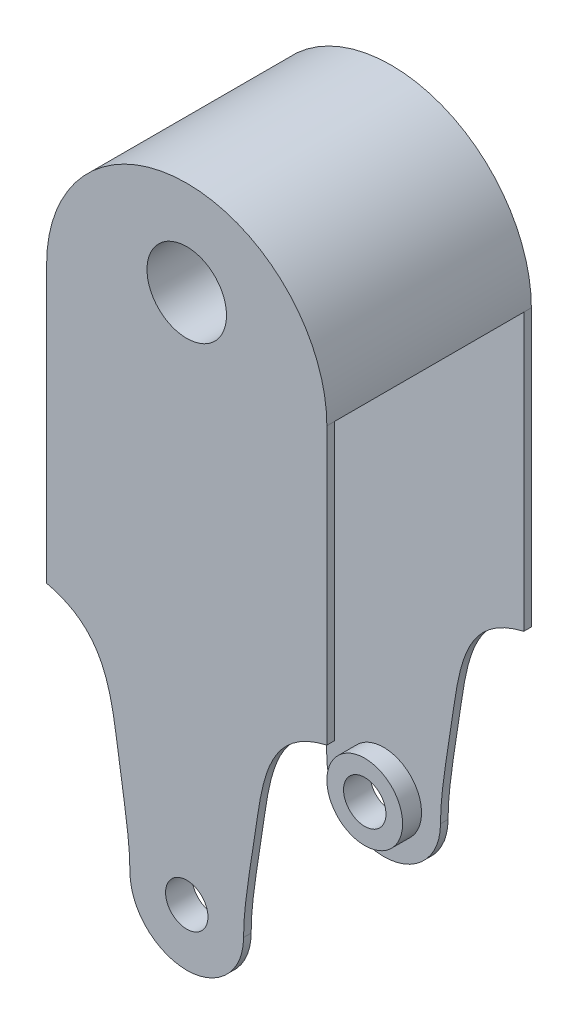
ISO-10303-21;
HEADER;
FILE_DESCRIPTION(('STEP AP214'),'2;1');
FILE_NAME('part.step','',(''),(''),'','','');
FILE_SCHEMA(('AUTOMOTIVE_DESIGN { 1 0 10303 214 1 1 1 1 }'));
ENDSEC;
DATA;
#1=APPLICATION_CONTEXT('core data for automotive mechanical design processes');
#2=APPLICATION_PROTOCOL_DEFINITION('international standard','automotive_design',2000,#1);
#3=PRODUCT_CONTEXT('',#1,'mechanical');
#4=PRODUCT('Part','Part','',(#3));
#5=PRODUCT_RELATED_PRODUCT_CATEGORY('part','',(#4));
#6=PRODUCT_DEFINITION_FORMATION('','',#4);
#7=PRODUCT_DEFINITION_CONTEXT('part definition',#1,'design');
#8=PRODUCT_DEFINITION('design','',#6,#7);
#9=PRODUCT_DEFINITION_SHAPE('','',#8);
#10=(LENGTH_UNIT() NAMED_UNIT(*) SI_UNIT(.MILLI.,.METRE.));
#11=(NAMED_UNIT(*) PLANE_ANGLE_UNIT() SI_UNIT($,.RADIAN.));
#12=(NAMED_UNIT(*) SI_UNIT($,.STERADIAN.) SOLID_ANGLE_UNIT());
#13=UNCERTAINTY_MEASURE_WITH_UNIT(LENGTH_MEASURE(1.E-05),#10,'distance_accuracy_value','');
#14=(GEOMETRIC_REPRESENTATION_CONTEXT(3) GLOBAL_UNCERTAINTY_ASSIGNED_CONTEXT((#13)) GLOBAL_UNIT_ASSIGNED_CONTEXT((#10,
#11,#12)) REPRESENTATION_CONTEXT('',''));
#15=CARTESIAN_POINT('',(0.,0.,0.));
#16=DIRECTION('',(0.,0.,1.));
#17=DIRECTION('',(1.,0.,0.));
#18=AXIS2_PLACEMENT_3D('',#15,#16,#17);
#19=CARTESIAN_POINT('',(0.,0.,54.));
#20=DIRECTION('',(1.,0.,0.));
#21=DIRECTION('',(0.,1.,0.));
#22=AXIS2_PLACEMENT_3D('',#19,#20,#21);
#23=PLANE('',#22);
#24=DIRECTION('',(0.,0.,-1.));
#25=VECTOR('',#24,1.);
#26=CARTESIAN_POINT('',(0.,70.,74.));
#27=LINE('',#26,#25);
#28=CARTESIAN_POINT('',(0.,70.,2.));
#29=VERTEX_POINT('',#28);
#30=CARTESIAN_POINT('',(0.,70.,0.));
#31=VERTEX_POINT('',#30);
#32=EDGE_CURVE('E413',#29,#31,#27,.T.);
#33=ORIENTED_EDGE('',*,*,#32,.F.);
#34=DIRECTION('',(0.,-1.,0.));
#35=VECTOR('',#34,1.);
#36=CARTESIAN_POINT('',(0.,70.,2.));
#37=LINE('',#36,#35);
#38=CARTESIAN_POINT('',(0.,143.,2.));
#39=VERTEX_POINT('',#38);
#40=EDGE_CURVE('E125',#39,#29,#37,.T.);
#41=ORIENTED_EDGE('',*,*,#40,.F.);
#42=DIRECTION('',(0.,0.,-1.));
#43=VECTOR('',#42,1.);
#44=CARTESIAN_POINT('',(0.,143.,54.));
#45=LINE('',#44,#43);
#46=CARTESIAN_POINT('',(0.,143.,0.));
#47=VERTEX_POINT('',#46);
#48=EDGE_CURVE('E118',#39,#47,#45,.T.);
#49=ORIENTED_EDGE('',*,*,#48,.T.);
#50=DIRECTION('',(0.,-1.,0.));
#51=VECTOR('',#50,1.);
#52=CARTESIAN_POINT('',(0.,0.,0.));
#53=LINE('',#52,#51);
#54=EDGE_CURVE('E122',#47,#31,#53,.T.);
#55=ORIENTED_EDGE('',*,*,#54,.T.);
#56=EDGE_LOOP('',(#33,#41,#49,#55));
#57=FACE_BOUND('',#56,.T.);
#58=ADVANCED_FACE('F78',(#57),#23,.F.);
#59=CARTESIAN_POINT('',(74.,0.,54.));
#60=DIRECTION('',(1.,0.,0.));
#61=DIRECTION('',(0.,1.,0.));
#62=AXIS2_PLACEMENT_3D('',#59,#60,#61);
#63=PLANE('',#62);
#64=DIRECTION('',(0.,-1.,0.));
#65=VECTOR('',#64,1.);
#66=CARTESIAN_POINT('',(74.,70.,2.));
#67=LINE('',#66,#65);
#68=CARTESIAN_POINT('',(74.,143.,2.));
#69=VERTEX_POINT('',#68);
#70=CARTESIAN_POINT('',(74.,70.,2.));
#71=VERTEX_POINT('',#70);
#72=EDGE_CURVE('E240',#69,#71,#67,.T.);
#73=ORIENTED_EDGE('',*,*,#72,.T.);
#74=DIRECTION('',(0.,0.,-1.));
#75=VECTOR('',#74,1.);
#76=CARTESIAN_POINT('',(74.,70.,74.));
#77=LINE('',#76,#75);
#78=CARTESIAN_POINT('',(74.,70.,0.));
#79=VERTEX_POINT('',#78);
#80=EDGE_CURVE('E316',#71,#79,#77,.T.);
#81=ORIENTED_EDGE('',*,*,#80,.T.);
#82=DIRECTION('',(0.,-1.,0.));
#83=VECTOR('',#82,1.);
#84=CARTESIAN_POINT('',(74.,0.,0.));
#85=LINE('',#84,#83);
#86=CARTESIAN_POINT('',(74.,143.,0.));
#87=VERTEX_POINT('',#86);
#88=EDGE_CURVE('E151',#87,#79,#85,.T.);
#89=ORIENTED_EDGE('',*,*,#88,.F.);
#90=DIRECTION('',(0.,0.,-1.));
#91=VECTOR('',#90,1.);
#92=CARTESIAN_POINT('',(74.,143.,54.));
#93=LINE('',#92,#91);
#94=EDGE_CURVE('E149',#69,#87,#93,.T.);
#95=ORIENTED_EDGE('',*,*,#94,.F.);
#96=EDGE_LOOP('',(#73,#81,#89,#95));
#97=FACE_BOUND('',#96,.T.);
#98=ADVANCED_FACE('F187',(#97),#63,.T.);
#99=CARTESIAN_POINT('',(0.,0.,2.));
#100=DIRECTION('',(0.,0.,-1.));
#101=DIRECTION('',(-1.,0.,0.));
#102=AXIS2_PLACEMENT_3D('',#99,#100,#101);
#103=PLANE('',#102);
#104=CARTESIAN_POINT('',(37.,15.,2.));
#105=DIRECTION('',(0.,0.,-1.));
#106=DIRECTION('',(-1.,0.,0.));
#107=AXIS2_PLACEMENT_3D('',#104,#105,#106);
#108=CIRCLE('',#107,15.);
#109=CARTESIAN_POINT('',(52.,15.,2.));
#110=VERTEX_POINT('',#109);
#111=CARTESIAN_POINT('',(22.,15.,2.));
#112=VERTEX_POINT('',#111);
#113=EDGE_CURVE('E167',#110,#112,#108,.T.);
#114=ORIENTED_EDGE('',*,*,#113,.F.);
#115=CARTESIAN_POINT('',(74.,70.,2.));
#116=CARTESIAN_POINT('',(58.0964865616181,66.3006355740785,2.));
#117=CARTESIAN_POINT('',(56.2222803573004,44.524463783592,2.));
#118=CARTESIAN_POINT('',(52.,22.3179609326105,2.));
#119=CARTESIAN_POINT('',(52.,15.,2.));
#120=B_SPLINE_CURVE_WITH_KNOTS('',3,(#115,#116,#117,#118,#119),.UNSPECIFIED.,.F.,.F.,(4,1,4),
(0.,0.600324724465974,1.),.UNSPECIFIED.);
#121=EDGE_CURVE('E332',#71,#110,#120,.T.);
#122=ORIENTED_EDGE('',*,*,#121,.F.);
#123=ORIENTED_EDGE('',*,*,#72,.F.);
#124=DIRECTION('',(-1.,0.,0.));
#125=VECTOR('',#124,1.);
#126=CARTESIAN_POINT('',(74.,143.,2.));
#127=LINE('',#126,#125);
#128=EDGE_CURVE('E232',#69,#39,#127,.T.);
#129=ORIENTED_EDGE('',*,*,#128,.T.);
#130=ORIENTED_EDGE('',*,*,#40,.T.);
#131=CARTESIAN_POINT('',(22.,15.,2.));
#132=CARTESIAN_POINT('',(22.,22.3179609326105,2.));
#133=CARTESIAN_POINT('',(17.7777196426996,44.524463783592,2.));
#134=CARTESIAN_POINT('',(15.9035134383819,66.3006355740785,2.));
#135=CARTESIAN_POINT('',(0.,70.,2.));
#136=B_SPLINE_CURVE_WITH_KNOTS('',3,(#131,#132,#133,#134,#135),.UNSPECIFIED.,.F.,.F.,(4,1,4),
(0.,0.399675275534026,1.),.UNSPECIFIED.);
#137=EDGE_CURVE('E407',#112,#29,#136,.T.);
#138=ORIENTED_EDGE('',*,*,#137,.F.);
#139=EDGE_LOOP('',(#114,#122,#123,#129,#130,#138));
#140=FACE_BOUND('',#139,.T.);
#141=CARTESIAN_POINT('',(37.,15.,2.));
#142=DIRECTION('',(0.,0.,-1.));
#143=DIRECTION('',(-1.,0.,0.));
#144=AXIS2_PLACEMENT_3D('',#141,#142,#143);
#145=CIRCLE('',#144,10.);
#146=CARTESIAN_POINT('',(27.,15.,2.));
#147=VERTEX_POINT('',#146);
#148=EDGE_CURVE('E12',#147,#147,#145,.F.);
#149=ORIENTED_EDGE('',*,*,#148,.F.);
#150=EDGE_LOOP('',(#149));
#151=FACE_BOUND('',#150,.T.);
#152=ADVANCED_FACE('F179',(#140,#151),#103,.F.);
#153=CARTESIAN_POINT('',(0.,70.,52.));
#154=DIRECTION('',(0.,0.,1.));
#155=DIRECTION('',(0.,-1.,0.));
#156=AXIS2_PLACEMENT_3D('',#153,#154,#155);
#157=PLANE('',#156);
#158=CARTESIAN_POINT('',(22.,15.,52.));
#159=CARTESIAN_POINT('',(22.,22.3179609326105,52.));
#160=CARTESIAN_POINT('',(17.7777196426996,44.524463783592,52.));
#161=CARTESIAN_POINT('',(15.9035134383819,66.3006355740785,52.));
#162=CARTESIAN_POINT('',(0.,70.,52.));
#163=B_SPLINE_CURVE_WITH_KNOTS('',3,(#158,#159,#160,#161,#162),.UNSPECIFIED.,.F.,.F.,(4,1,4),
(0.,0.399675275534026,1.),.UNSPECIFIED.);
#164=CARTESIAN_POINT('',(0.,70.,52.));
#165=VERTEX_POINT('',#164);
#166=CARTESIAN_POINT('',(22.,15.,52.));
#167=VERTEX_POINT('',#166);
#168=EDGE_CURVE('E405',#165,#167,#163,.F.);
#169=ORIENTED_EDGE('',*,*,#168,.F.);
#170=DIRECTION('',(0.,1.,0.));
#171=VECTOR('',#170,1.);
#172=CARTESIAN_POINT('',(0.,143.,52.));
#173=LINE('',#172,#171);
#174=CARTESIAN_POINT('',(0.,143.,52.));
#175=VERTEX_POINT('',#174);
#176=EDGE_CURVE('E212',#165,#175,#173,.T.);
#177=ORIENTED_EDGE('',*,*,#176,.T.);
#178=DIRECTION('',(-1.,0.,0.));
#179=VECTOR('',#178,1.);
#180=CARTESIAN_POINT('',(74.,143.,52.));
#181=LINE('',#180,#179);
#182=CARTESIAN_POINT('',(74.,143.,52.));
#183=VERTEX_POINT('',#182);
#184=EDGE_CURVE('E237',#183,#175,#181,.T.);
#185=ORIENTED_EDGE('',*,*,#184,.F.);
#186=DIRECTION('',(0.,1.,0.));
#187=VECTOR('',#186,1.);
#188=CARTESIAN_POINT('',(74.,143.,52.));
#189=LINE('',#188,#187);
#190=CARTESIAN_POINT('',(74.,70.,52.));
#191=VERTEX_POINT('',#190);
#192=EDGE_CURVE('E227',#191,#183,#189,.T.);
#193=ORIENTED_EDGE('',*,*,#192,.F.);
#194=CARTESIAN_POINT('',(74.,70.,52.));
#195=CARTESIAN_POINT('',(58.0964865616181,66.3006355740785,52.));
#196=CARTESIAN_POINT('',(56.2222803573004,44.524463783592,52.));
#197=CARTESIAN_POINT('',(52.,22.3179609326105,52.));
#198=CARTESIAN_POINT('',(52.,15.,52.));
#199=B_SPLINE_CURVE_WITH_KNOTS('',3,(#194,#195,#196,#197,#198),.UNSPECIFIED.,.F.,.F.,(4,1,4),
(0.,0.600324724465974,1.),.UNSPECIFIED.);
#200=CARTESIAN_POINT('',(52.,15.,52.));
#201=VERTEX_POINT('',#200);
#202=EDGE_CURVE('E338',#201,#191,#199,.F.);
#203=ORIENTED_EDGE('',*,*,#202,.F.);
#204=CARTESIAN_POINT('',(37.,15.,52.));
#205=DIRECTION('',(0.,0.,1.));
#206=DIRECTION('',(1.,0.,0.));
#207=AXIS2_PLACEMENT_3D('',#204,#205,#206);
#208=CIRCLE('',#207,15.);
#209=EDGE_CURVE('E94',#167,#201,#208,.T.);
#210=ORIENTED_EDGE('',*,*,#209,.F.);
#211=EDGE_LOOP('',(#169,#177,#185,#193,#203,#210));
#212=FACE_BOUND('',#211,.T.);
#213=CARTESIAN_POINT('',(37.,15.,52.));
#214=DIRECTION('',(0.,0.,1.));
#215=DIRECTION('',(0.,-1.,0.));
#216=AXIS2_PLACEMENT_3D('',#213,#214,#215);
#217=CIRCLE('',#216,10.);
#218=CARTESIAN_POINT('',(37.,5.,52.));
#219=VERTEX_POINT('',#218);
#220=EDGE_CURVE('E87',#219,#219,#217,.F.);
#221=ORIENTED_EDGE('',*,*,#220,.F.);
#222=EDGE_LOOP('',(#221));
#223=FACE_BOUND('',#222,.T.);
#224=ADVANCED_FACE('F176',(#212,#223),#157,.F.);
#225=CARTESIAN_POINT('',(0.,0.,54.));
#226=DIRECTION('',(0.,0.,1.));
#227=DIRECTION('',(1.,0.,0.));
#228=AXIS2_PLACEMENT_3D('',#225,#226,#227);
#229=PLANE('',#228);
#230=CARTESIAN_POINT('',(37.,15.,54.));
#231=DIRECTION('',(0.,0.,1.));
#232=DIRECTION('',(1.,0.,0.));
#233=AXIS2_PLACEMENT_3D('',#230,#231,#232);
#234=CIRCLE('',#233,5.6);
#235=CARTESIAN_POINT('',(42.6,15.,54.));
#236=VERTEX_POINT('',#235);
#237=EDGE_CURVE('E260',#236,#236,#234,.T.);
#238=ORIENTED_EDGE('',*,*,#237,.F.);
#239=EDGE_LOOP('',(#238));
#240=FACE_BOUND('',#239,.T.);
#241=CARTESIAN_POINT('',(37.,155.,54.));
#242=DIRECTION('',(0.,0.,1.));
#243=DIRECTION('',(1.,0.,0.));
#244=AXIS2_PLACEMENT_3D('',#241,#242,#243);
#245=CIRCLE('',#244,10.5);
#246=CARTESIAN_POINT('',(47.5,155.,54.));
#247=VERTEX_POINT('',#246);
#248=EDGE_CURVE('E131',#247,#247,#245,.T.);
#249=ORIENTED_EDGE('',*,*,#248,.F.);
#250=EDGE_LOOP('',(#249));
#251=FACE_BOUND('',#250,.T.);
#252=DIRECTION('',(0.,-1.,0.));
#253=VECTOR('',#252,1.);
#254=CARTESIAN_POINT('',(0.,0.,54.));
#255=LINE('',#254,#253);
#256=CARTESIAN_POINT('',(0.,143.,54.));
#257=VERTEX_POINT('',#256);
#258=CARTESIAN_POINT('',(0.,70.,54.));
#259=VERTEX_POINT('',#258);
#260=EDGE_CURVE('E103',#257,#259,#255,.T.);
#261=ORIENTED_EDGE('',*,*,#260,.T.);
#262=CARTESIAN_POINT('',(22.,15.,54.));
#263=CARTESIAN_POINT('',(22.,22.3179609326105,54.));
#264=CARTESIAN_POINT('',(17.7777196426996,44.524463783592,54.));
#265=CARTESIAN_POINT('',(15.9035134383819,66.3006355740785,54.));
#266=CARTESIAN_POINT('',(0.,70.,54.));
#267=B_SPLINE_CURVE_WITH_KNOTS('',3,(#262,#263,#264,#265,#266),.UNSPECIFIED.,.F.,.F.,(4,1,4),
(0.,0.399675275534026,1.),.UNSPECIFIED.);
#268=CARTESIAN_POINT('',(22.,15.,54.));
#269=VERTEX_POINT('',#268);
#270=EDGE_CURVE('E297',#259,#269,#267,.F.);
#271=ORIENTED_EDGE('',*,*,#270,.T.);
#272=CARTESIAN_POINT('',(37.,15.,54.));
#273=DIRECTION('',(0.,0.,1.));
#274=DIRECTION('',(1.,0.,0.));
#275=AXIS2_PLACEMENT_3D('',#272,#273,#274);
#276=CIRCLE('',#275,15.);
#277=CARTESIAN_POINT('',(52.,15.,54.));
#278=VERTEX_POINT('',#277);
#279=EDGE_CURVE('E328',#269,#278,#276,.T.);
#280=ORIENTED_EDGE('',*,*,#279,.T.);
#281=CARTESIAN_POINT('',(74.,70.,54.));
#282=CARTESIAN_POINT('',(58.0964865616181,66.3006355740785,54.));
#283=CARTESIAN_POINT('',(56.2222803573004,44.524463783592,54.));
#284=CARTESIAN_POINT('',(52.,22.3179609326105,54.));
#285=CARTESIAN_POINT('',(52.,15.,54.));
#286=B_SPLINE_CURVE_WITH_KNOTS('',3,(#281,#282,#283,#284,#285),.UNSPECIFIED.,.F.,.F.,(4,1,4),
(0.,0.600324724465974,1.),.UNSPECIFIED.);
#287=CARTESIAN_POINT('',(74.,70.,54.));
#288=VERTEX_POINT('',#287);
#289=EDGE_CURVE('E154',#278,#288,#286,.F.);
#290=ORIENTED_EDGE('',*,*,#289,.T.);
#291=DIRECTION('',(0.,-1.,0.));
#292=VECTOR('',#291,1.);
#293=CARTESIAN_POINT('',(74.,0.,54.));
#294=LINE('',#293,#292);
#295=CARTESIAN_POINT('',(74.,143.,54.));
#296=VERTEX_POINT('',#295);
#297=EDGE_CURVE('E160',#296,#288,#294,.T.);
#298=ORIENTED_EDGE('',*,*,#297,.F.);
#299=CARTESIAN_POINT('',(37.,143.,54.));
#300=DIRECTION('',(0.,0.,1.));
#301=DIRECTION('',(1.,0.,0.));
#302=AXIS2_PLACEMENT_3D('',#299,#300,#301);
#303=CIRCLE('',#302,37.);
#304=EDGE_CURVE('E217',#296,#257,#303,.T.);
#305=ORIENTED_EDGE('',*,*,#304,.T.);
#306=EDGE_LOOP('',(#261,#271,#280,#290,#298,#305));
#307=FACE_BOUND('',#306,.T.);
#308=ADVANCED_FACE('F178',(#240,#251,#307),#229,.T.);
#309=CARTESIAN_POINT('',(0.,0.,0.));
#310=DIRECTION('',(0.,0.,1.));
#311=DIRECTION('',(1.,0.,0.));
#312=AXIS2_PLACEMENT_3D('',#309,#310,#311);
#313=PLANE('',#312);
#314=CARTESIAN_POINT('',(37.,15.,0.));
#315=DIRECTION('',(0.,0.,-1.));
#316=DIRECTION('',(-1.,0.,0.));
#317=AXIS2_PLACEMENT_3D('',#314,#315,#316);
#318=CIRCLE('',#317,5.6);
#319=CARTESIAN_POINT('',(31.4,15.,0.));
#320=VERTEX_POINT('',#319);
#321=EDGE_CURVE('E256',#320,#320,#318,.T.);
#322=ORIENTED_EDGE('',*,*,#321,.F.);
#323=EDGE_LOOP('',(#322));
#324=FACE_BOUND('',#323,.T.);
#325=CARTESIAN_POINT('',(37.,155.,0.));
#326=DIRECTION('',(0.,0.,1.));
#327=DIRECTION('',(1.,0.,0.));
#328=AXIS2_PLACEMENT_3D('',#325,#326,#327);
#329=CIRCLE('',#328,10.5);
#330=CARTESIAN_POINT('',(47.5,155.,0.));
#331=VERTEX_POINT('',#330);
#332=EDGE_CURVE('E144',#331,#331,#329,.T.);
#333=ORIENTED_EDGE('',*,*,#332,.T.);
#334=EDGE_LOOP('',(#333));
#335=FACE_BOUND('',#334,.T.);
#336=CARTESIAN_POINT('',(22.,15.,0.));
#337=CARTESIAN_POINT('',(22.,22.3179609326105,0.));
#338=CARTESIAN_POINT('',(17.7777196426996,44.524463783592,0.));
#339=CARTESIAN_POINT('',(15.9035134383819,66.3006355740785,0.));
#340=CARTESIAN_POINT('',(0.,70.,0.));
#341=B_SPLINE_CURVE_WITH_KNOTS('',3,(#336,#337,#338,#339,#340),.UNSPECIFIED.,.F.,.F.,(4,1,4),
(0.,0.399675275534026,1.),.UNSPECIFIED.);
#342=CARTESIAN_POINT('',(22.,15.,0.));
#343=VERTEX_POINT('',#342);
#344=EDGE_CURVE('E142',#343,#31,#341,.T.);
#345=ORIENTED_EDGE('',*,*,#344,.T.);
#346=ORIENTED_EDGE('',*,*,#54,.F.);
#347=CARTESIAN_POINT('',(37.,143.,0.));
#348=DIRECTION('',(0.,0.,1.));
#349=DIRECTION('',(1.,0.,0.));
#350=AXIS2_PLACEMENT_3D('',#347,#348,#349);
#351=CIRCLE('',#350,37.);
#352=EDGE_CURVE('E138',#87,#47,#351,.T.);
#353=ORIENTED_EDGE('',*,*,#352,.F.);
#354=ORIENTED_EDGE('',*,*,#88,.T.);
#355=CARTESIAN_POINT('',(74.,70.,0.));
#356=CARTESIAN_POINT('',(58.0964865616181,66.3006355740785,0.));
#357=CARTESIAN_POINT('',(56.2222803573004,44.524463783592,0.));
#358=CARTESIAN_POINT('',(52.,22.3179609326105,0.));
#359=CARTESIAN_POINT('',(52.,15.,0.));
#360=B_SPLINE_CURVE_WITH_KNOTS('',3,(#355,#356,#357,#358,#359),.UNSPECIFIED.,.F.,.F.,(4,1,4),
(0.,0.600324724465974,1.),.UNSPECIFIED.);
#361=CARTESIAN_POINT('',(52.,15.,0.));
#362=VERTEX_POINT('',#361);
#363=EDGE_CURVE('E301',#79,#362,#360,.T.);
#364=ORIENTED_EDGE('',*,*,#363,.T.);
#365=CARTESIAN_POINT('',(37.,15.,0.));
#366=DIRECTION('',(0.,0.,-1.));
#367=DIRECTION('',(-1.,0.,0.));
#368=AXIS2_PLACEMENT_3D('',#365,#366,#367);
#369=CIRCLE('',#368,15.);
#370=EDGE_CURVE('E310',#362,#343,#369,.T.);
#371=ORIENTED_EDGE('',*,*,#370,.T.);
#372=EDGE_LOOP('',(#345,#346,#353,#354,#364,#371));
#373=FACE_BOUND('',#372,.T.);
#374=ADVANCED_FACE('F136',(#324,#335,#373),#313,.F.);
#375=EDGE_CURVE('E130',#257,#175,#45,.T.);
#376=ORIENTED_EDGE('',*,*,#375,.T.);
#377=ORIENTED_EDGE('',*,*,#176,.F.);
#378=EDGE_CURVE('E410',#259,#165,#27,.T.);
#379=ORIENTED_EDGE('',*,*,#378,.F.);
#380=ORIENTED_EDGE('',*,*,#260,.F.);
#381=EDGE_LOOP('',(#376,#377,#379,#380));
#382=FACE_BOUND('',#381,.T.);
#383=ADVANCED_FACE('F193',(#382),#23,.F.);
#384=ORIENTED_EDGE('',*,*,#192,.T.);
#385=EDGE_CURVE('E163',#296,#183,#93,.T.);
#386=ORIENTED_EDGE('',*,*,#385,.F.);
#387=ORIENTED_EDGE('',*,*,#297,.T.);
#388=EDGE_CURVE('E322',#288,#191,#77,.T.);
#389=ORIENTED_EDGE('',*,*,#388,.T.);
#390=EDGE_LOOP('',(#384,#386,#387,#389));
#391=FACE_BOUND('',#390,.T.);
#392=ADVANCED_FACE('F80',(#391),#63,.T.);
#393=CARTESIAN_POINT('',(37.,143.,54.));
#394=DIRECTION('',(0.,0.,-1.));
#395=DIRECTION('',(-1.,0.,0.));
#396=AXIS2_PLACEMENT_3D('',#393,#394,#395);
#397=CYLINDRICAL_SURFACE('',#396,37.);
#398=ORIENTED_EDGE('',*,*,#352,.T.);
#399=ORIENTED_EDGE('',*,*,#48,.F.);
#400=DIRECTION('',(0.,0.,-1.));
#401=VECTOR('',#400,1.);
#402=CARTESIAN_POINT('',(0.,143.,2.));
#403=LINE('',#402,#401);
#404=EDGE_CURVE('E220',#175,#39,#403,.T.);
#405=ORIENTED_EDGE('',*,*,#404,.F.);
#406=ORIENTED_EDGE('',*,*,#375,.F.);
#407=ORIENTED_EDGE('',*,*,#304,.F.);
#408=ORIENTED_EDGE('',*,*,#385,.T.);
#409=DIRECTION('',(0.,0.,-1.));
#410=VECTOR('',#409,1.);
#411=CARTESIAN_POINT('',(74.,143.,2.));
#412=LINE('',#411,#410);
#413=EDGE_CURVE('E424',#183,#69,#412,.T.);
#414=ORIENTED_EDGE('',*,*,#413,.T.);
#415=ORIENTED_EDGE('',*,*,#94,.T.);
#416=EDGE_LOOP('',(#398,#399,#405,#406,#407,#408,#414,#415));
#417=FACE_BOUND('',#416,.T.);
#418=ADVANCED_FACE('F146',(#417),#397,.T.);
#419=CARTESIAN_POINT('',(37.,155.,54.));
#420=DIRECTION('',(0.,0.,-1.));
#421=DIRECTION('',(-1.,0.,0.));
#422=AXIS2_PLACEMENT_3D('',#419,#420,#421);
#423=CYLINDRICAL_SURFACE('',#422,10.5);
#424=ORIENTED_EDGE('',*,*,#248,.T.);
#425=EDGE_LOOP('',(#424));
#426=FACE_BOUND('',#425,.T.);
#427=ORIENTED_EDGE('',*,*,#332,.F.);
#428=EDGE_LOOP('',(#427));
#429=FACE_BOUND('',#428,.T.);
#430=ADVANCED_FACE('F368',(#426,#429),#423,.F.);
#431=CARTESIAN_POINT('',(37.,15.,74.));
#432=DIRECTION('',(0.,0.,-1.));
#433=DIRECTION('',(-1.,0.,0.));
#434=AXIS2_PLACEMENT_3D('',#431,#432,#433);
#435=CYLINDRICAL_SURFACE('',#434,15.);
#436=ORIENTED_EDGE('',*,*,#113,.T.);
#437=DIRECTION('',(0.,0.,-1.));
#438=VECTOR('',#437,1.);
#439=CARTESIAN_POINT('',(22.,15.,74.));
#440=LINE('',#439,#438);
#441=EDGE_CURVE('E417',#112,#343,#440,.T.);
#442=ORIENTED_EDGE('',*,*,#441,.T.);
#443=ORIENTED_EDGE('',*,*,#370,.F.);
#444=DIRECTION('',(0.,0.,-1.));
#445=VECTOR('',#444,1.);
#446=CARTESIAN_POINT('',(52.,15.,74.));
#447=LINE('',#446,#445);
#448=EDGE_CURVE('E317',#110,#362,#447,.T.);
#449=ORIENTED_EDGE('',*,*,#448,.F.);
#450=EDGE_LOOP('',(#436,#442,#443,#449));
#451=FACE_BOUND('',#450,.T.);
#452=ADVANCED_FACE('F287',(#451),#435,.T.);
#453=CARTESIAN_POINT('',(74.,70.,74.));
#454=CARTESIAN_POINT('',(58.0964865616181,66.3006355740785,74.));
#455=CARTESIAN_POINT('',(56.2222803573004,44.524463783592,74.));
#456=CARTESIAN_POINT('',(52.,22.3179609326105,74.));
#457=CARTESIAN_POINT('',(52.,15.,74.));
#458=B_SPLINE_CURVE_WITH_KNOTS('',3,(#453,#454,#455,#456,#457),.UNSPECIFIED.,.F.,.F.,(4,1,4),
(0.,0.600324724465974,1.),.UNSPECIFIED.);
#459=DIRECTION('',(0.,0.,-1.));
#460=VECTOR('',#459,1.);
#461=SURFACE_OF_LINEAR_EXTRUSION('',#458,#460);
#462=ORIENTED_EDGE('',*,*,#121,.T.);
#463=ORIENTED_EDGE('',*,*,#448,.T.);
#464=ORIENTED_EDGE('',*,*,#363,.F.);
#465=ORIENTED_EDGE('',*,*,#80,.F.);
#466=EDGE_LOOP('',(#462,#463,#464,#465));
#467=FACE_BOUND('',#466,.T.);
#468=ADVANCED_FACE('F290',(#467),#461,.T.);
#469=EDGE_CURVE('E321',#278,#201,#447,.T.);
#470=ORIENTED_EDGE('',*,*,#469,.T.);
#471=ORIENTED_EDGE('',*,*,#202,.T.);
#472=ORIENTED_EDGE('',*,*,#388,.F.);
#473=ORIENTED_EDGE('',*,*,#289,.F.);
#474=EDGE_LOOP('',(#470,#471,#472,#473));
#475=FACE_BOUND('',#474,.T.);
#476=ADVANCED_FACE('F285',(#475),#461,.T.);
#477=ORIENTED_EDGE('',*,*,#209,.T.);
#478=ORIENTED_EDGE('',*,*,#469,.F.);
#479=ORIENTED_EDGE('',*,*,#279,.F.);
#480=EDGE_CURVE('E415',#269,#167,#440,.T.);
#481=ORIENTED_EDGE('',*,*,#480,.T.);
#482=EDGE_LOOP('',(#477,#478,#479,#481));
#483=FACE_BOUND('',#482,.T.);
#484=ADVANCED_FACE('F280',(#483),#435,.T.);
#485=CARTESIAN_POINT('',(22.,15.,74.));
#486=CARTESIAN_POINT('',(22.,22.3179609326105,74.));
#487=CARTESIAN_POINT('',(17.7777196426996,44.524463783592,74.));
#488=CARTESIAN_POINT('',(15.9035134383819,66.3006355740785,74.));
#489=CARTESIAN_POINT('',(0.,70.,74.));
#490=B_SPLINE_CURVE_WITH_KNOTS('',3,(#485,#486,#487,#488,#489),.UNSPECIFIED.,.F.,.F.,(4,1,4),
(0.,0.399675275534026,1.),.UNSPECIFIED.);
#491=DIRECTION('',(0.,0.,-1.));
#492=VECTOR('',#491,1.);
#493=SURFACE_OF_LINEAR_EXTRUSION('',#490,#492);
#494=ORIENTED_EDGE('',*,*,#168,.T.);
#495=ORIENTED_EDGE('',*,*,#480,.F.);
#496=ORIENTED_EDGE('',*,*,#270,.F.);
#497=ORIENTED_EDGE('',*,*,#378,.T.);
#498=EDGE_LOOP('',(#494,#495,#496,#497));
#499=FACE_BOUND('',#498,.T.);
#500=ADVANCED_FACE('F275',(#499),#493,.T.);
#501=ORIENTED_EDGE('',*,*,#441,.F.);
#502=ORIENTED_EDGE('',*,*,#137,.T.);
#503=ORIENTED_EDGE('',*,*,#32,.T.);
#504=ORIENTED_EDGE('',*,*,#344,.F.);
#505=EDGE_LOOP('',(#501,#502,#503,#504));
#506=FACE_BOUND('',#505,.T.);
#507=ADVANCED_FACE('F279',(#506),#493,.T.);
#508=CARTESIAN_POINT('',(37.,15.,74.));
#509=DIRECTION('',(0.,0.,-1.));
#510=DIRECTION('',(-1.,0.,0.));
#511=AXIS2_PLACEMENT_3D('',#508,#509,#510);
#512=CYLINDRICAL_SURFACE('',#511,5.6);
#513=ORIENTED_EDGE('',*,*,#321,.T.);
#514=EDGE_LOOP('',(#513));
#515=FACE_BOUND('',#514,.T.);
#516=CARTESIAN_POINT('',(37.,15.,7.));
#517=DIRECTION('',(0.,0.,1.));
#518=DIRECTION('',(1.,0.,0.));
#519=AXIS2_PLACEMENT_3D('',#516,#517,#518);
#520=CIRCLE('',#519,5.6);
#521=CARTESIAN_POINT('',(42.6,15.,7.));
#522=VERTEX_POINT('',#521);
#523=EDGE_CURVE('E236',#522,#522,#520,.T.);
#524=ORIENTED_EDGE('',*,*,#523,.T.);
#525=EDGE_LOOP('',(#524));
#526=FACE_BOUND('',#525,.T.);
#527=ADVANCED_FACE('F461',(#515,#526),#512,.F.);
#528=ORIENTED_EDGE('',*,*,#237,.T.);
#529=EDGE_LOOP('',(#528));
#530=FACE_BOUND('',#529,.T.);
#531=CARTESIAN_POINT('',(37.,15.,47.));
#532=DIRECTION('',(0.,0.,-1.));
#533=DIRECTION('',(0.,1.,0.));
#534=AXIS2_PLACEMENT_3D('',#531,#532,#533);
#535=CIRCLE('',#534,5.6);
#536=CARTESIAN_POINT('',(37.,20.6,47.));
#537=VERTEX_POINT('',#536);
#538=EDGE_CURVE('E248',#537,#537,#535,.T.);
#539=ORIENTED_EDGE('',*,*,#538,.T.);
#540=EDGE_LOOP('',(#539));
#541=FACE_BOUND('',#540,.T.);
#542=ADVANCED_FACE('F282',(#530,#541),#512,.F.);
#543=CARTESIAN_POINT('',(37.,15.,47.));
#544=DIRECTION('',(0.,0.,-1.));
#545=DIRECTION('',(0.,1.,0.));
#546=AXIS2_PLACEMENT_3D('',#543,#544,#545);
#547=PLANE('',#546);
#548=CARTESIAN_POINT('',(37.,15.,47.));
#549=DIRECTION('',(0.,0.,-1.));
#550=DIRECTION('',(0.,1.,0.));
#551=AXIS2_PLACEMENT_3D('',#548,#549,#550);
#552=CIRCLE('',#551,10.);
#553=CARTESIAN_POINT('',(37.,25.,47.));
#554=VERTEX_POINT('',#553);
#555=EDGE_CURVE('E252',#554,#554,#552,.T.);
#556=ORIENTED_EDGE('',*,*,#555,.T.);
#557=EDGE_LOOP('',(#556));
#558=FACE_BOUND('',#557,.T.);
#559=ORIENTED_EDGE('',*,*,#538,.F.);
#560=EDGE_LOOP('',(#559));
#561=FACE_BOUND('',#560,.T.);
#562=ADVANCED_FACE('F469',(#558,#561),#547,.T.);
#563=CARTESIAN_POINT('',(37.,15.,47.));
#564=DIRECTION('',(0.,0.,1.));
#565=DIRECTION('',(0.,-1.,0.));
#566=AXIS2_PLACEMENT_3D('',#563,#564,#565);
#567=CYLINDRICAL_SURFACE('',#566,10.);
#568=ORIENTED_EDGE('',*,*,#555,.F.);
#569=EDGE_LOOP('',(#568));
#570=FACE_BOUND('',#569,.T.);
#571=ORIENTED_EDGE('',*,*,#220,.T.);
#572=EDGE_LOOP('',(#571));
#573=FACE_BOUND('',#572,.T.);
#574=ADVANCED_FACE('F174',(#570,#573),#567,.T.);
#575=CARTESIAN_POINT('',(37.,15.,7.));
#576=DIRECTION('',(0.,0.,1.));
#577=DIRECTION('',(1.,0.,0.));
#578=AXIS2_PLACEMENT_3D('',#575,#576,#577);
#579=PLANE('',#578);
#580=CARTESIAN_POINT('',(37.,15.,7.));
#581=DIRECTION('',(0.,0.,1.));
#582=DIRECTION('',(1.,0.,0.));
#583=AXIS2_PLACEMENT_3D('',#580,#581,#582);
#584=CIRCLE('',#583,10.);
#585=CARTESIAN_POINT('',(47.,15.,7.));
#586=VERTEX_POINT('',#585);
#587=EDGE_CURVE('E244',#586,#586,#584,.T.);
#588=ORIENTED_EDGE('',*,*,#587,.T.);
#589=EDGE_LOOP('',(#588));
#590=FACE_BOUND('',#589,.T.);
#591=ORIENTED_EDGE('',*,*,#523,.F.);
#592=EDGE_LOOP('',(#591));
#593=FACE_BOUND('',#592,.T.);
#594=ADVANCED_FACE('F475',(#590,#593),#579,.T.);
#595=CARTESIAN_POINT('',(37.,15.,7.));
#596=DIRECTION('',(0.,0.,-1.));
#597=DIRECTION('',(-1.,0.,0.));
#598=AXIS2_PLACEMENT_3D('',#595,#596,#597);
#599=CYLINDRICAL_SURFACE('',#598,10.);
#600=ORIENTED_EDGE('',*,*,#587,.F.);
#601=EDGE_LOOP('',(#600));
#602=FACE_BOUND('',#601,.T.);
#603=ORIENTED_EDGE('',*,*,#148,.T.);
#604=EDGE_LOOP('',(#603));
#605=FACE_BOUND('',#604,.T.);
#606=ADVANCED_FACE('F477',(#602,#605),#599,.T.);
#607=CARTESIAN_POINT('',(74.,143.,2.));
#608=DIRECTION('',(0.,1.,0.));
#609=DIRECTION('',(-1.,0.,0.));
#610=AXIS2_PLACEMENT_3D('',#607,#608,#609);
#611=PLANE('',#610);
#612=ORIENTED_EDGE('',*,*,#404,.T.);
#613=ORIENTED_EDGE('',*,*,#128,.F.);
#614=ORIENTED_EDGE('',*,*,#413,.F.);
#615=ORIENTED_EDGE('',*,*,#184,.T.);
#616=EDGE_LOOP('',(#612,#613,#614,#615));
#617=FACE_BOUND('',#616,.T.);
#618=ADVANCED_FACE('F437',(#617),#611,.F.);
#619=CLOSED_SHELL('',(#58,#98,#152,#224,#308,#374,#383,#392,#418,#430,#452,#468,#476,#484,#500,
#507,#527,#542,#562,#574,#594,#606,#618));
#620=MANIFOLD_SOLID_BREP('B2',#619);
#621=ADVANCED_BREP_SHAPE_REPRESENTATION('',(#18,#620),#14);
#622=SHAPE_DEFINITION_REPRESENTATION(#9,#621);
ENDSEC;
END-ISO-10303-21;
